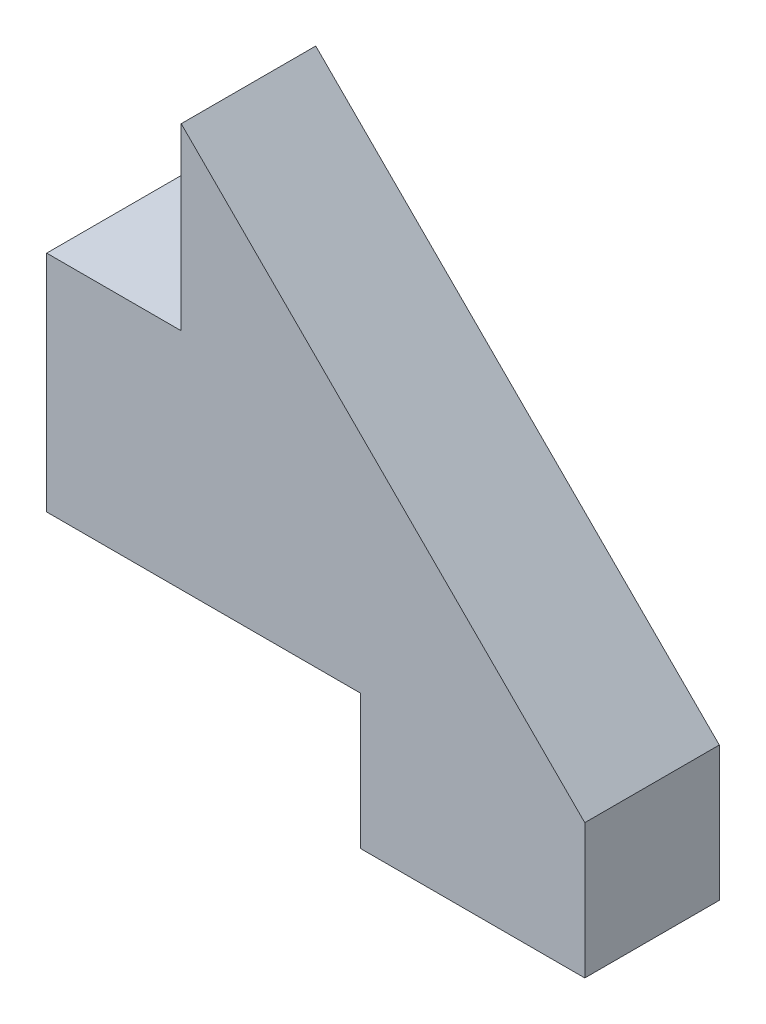
ISO-10303-21;
HEADER;
FILE_DESCRIPTION(('STEP AP214'),'2;1');
FILE_NAME('part.step','',(''),(''),'','','');
FILE_SCHEMA(('AUTOMOTIVE_DESIGN { 1 0 10303 214 1 1 1 1 }'));
ENDSEC;
DATA;
#1=APPLICATION_CONTEXT('core data for automotive mechanical design processes');
#2=APPLICATION_PROTOCOL_DEFINITION('international standard','automotive_design',2000,#1);
#3=PRODUCT_CONTEXT('',#1,'mechanical');
#4=PRODUCT('Part','Part','',(#3));
#5=PRODUCT_RELATED_PRODUCT_CATEGORY('part','',(#4));
#6=PRODUCT_DEFINITION_FORMATION('','',#4);
#7=PRODUCT_DEFINITION_CONTEXT('part definition',#1,'design');
#8=PRODUCT_DEFINITION('design','',#6,#7);
#9=PRODUCT_DEFINITION_SHAPE('','',#8);
#10=(LENGTH_UNIT() NAMED_UNIT(*) SI_UNIT(.MILLI.,.METRE.));
#11=(NAMED_UNIT(*) PLANE_ANGLE_UNIT() SI_UNIT($,.RADIAN.));
#12=(NAMED_UNIT(*) SI_UNIT($,.STERADIAN.) SOLID_ANGLE_UNIT());
#13=UNCERTAINTY_MEASURE_WITH_UNIT(LENGTH_MEASURE(1.E-05),#10,'distance_accuracy_value','');
#14=(GEOMETRIC_REPRESENTATION_CONTEXT(3) GLOBAL_UNCERTAINTY_ASSIGNED_CONTEXT((#13)) GLOBAL_UNIT_ASSIGNED_CONTEXT((#10,
#11,#12)) REPRESENTATION_CONTEXT('',''));
#15=CARTESIAN_POINT('',(0.,0.,0.));
#16=DIRECTION('',(0.,0.,1.));
#17=DIRECTION('',(1.,0.,0.));
#18=AXIS2_PLACEMENT_3D('',#15,#16,#17);
#19=CARTESIAN_POINT('',(0.,10.,6.));
#20=DIRECTION('',(0.,-1.,0.));
#21=DIRECTION('',(1.,0.,0.));
#22=AXIS2_PLACEMENT_3D('',#19,#20,#21);
#23=PLANE('',#22);
#24=DIRECTION('',(-1.,0.,0.));
#25=VECTOR('',#24,1.);
#26=CARTESIAN_POINT('',(0.,10.,0.));
#27=LINE('',#26,#25);
#28=CARTESIAN_POINT('',(6.,10.,0.));
#29=VERTEX_POINT('',#28);
#30=CARTESIAN_POINT('',(0.,10.,0.));
#31=VERTEX_POINT('',#30);
#32=EDGE_CURVE('E129',#29,#31,#27,.T.);
#33=ORIENTED_EDGE('',*,*,#32,.T.);
#34=DIRECTION('',(0.,0.,-1.));
#35=VECTOR('',#34,1.);
#36=CARTESIAN_POINT('',(0.,10.,6.));
#37=LINE('',#36,#35);
#38=CARTESIAN_POINT('',(0.,10.,6.));
#39=VERTEX_POINT('',#38);
#40=EDGE_CURVE('E11',#39,#31,#37,.T.);
#41=ORIENTED_EDGE('',*,*,#40,.F.);
#42=DIRECTION('',(-1.,0.,0.));
#43=VECTOR('',#42,1.);
#44=CARTESIAN_POINT('',(0.,10.,6.));
#45=LINE('',#44,#43);
#46=CARTESIAN_POINT('',(6.,10.,6.));
#47=VERTEX_POINT('',#46);
#48=EDGE_CURVE('E143',#47,#39,#45,.T.);
#49=ORIENTED_EDGE('',*,*,#48,.F.);
#50=DIRECTION('',(0.,0.,-1.));
#51=VECTOR('',#50,1.);
#52=CARTESIAN_POINT('',(6.,10.,6.));
#53=LINE('',#52,#51);
#54=EDGE_CURVE('E125',#47,#29,#53,.T.);
#55=ORIENTED_EDGE('',*,*,#54,.T.);
#56=EDGE_LOOP('',(#33,#41,#49,#55));
#57=FACE_BOUND('',#56,.T.);
#58=ADVANCED_FACE('F33',(#57),#23,.F.);
#59=CARTESIAN_POINT('',(0.,0.,6.));
#60=DIRECTION('',(1.,0.,0.));
#61=DIRECTION('',(0.,0.,-1.));
#62=AXIS2_PLACEMENT_3D('',#59,#60,#61);
#63=PLANE('',#62);
#64=DIRECTION('',(0.,-1.,0.));
#65=VECTOR('',#64,1.);
#66=CARTESIAN_POINT('',(0.,0.,0.));
#67=LINE('',#66,#65);
#68=CARTESIAN_POINT('',(0.,0.,0.));
#69=VERTEX_POINT('',#68);
#70=EDGE_CURVE('E132',#31,#69,#67,.T.);
#71=ORIENTED_EDGE('',*,*,#70,.T.);
#72=DIRECTION('',(0.,0.,-1.));
#73=VECTOR('',#72,1.);
#74=CARTESIAN_POINT('',(0.,0.,6.));
#75=LINE('',#74,#73);
#76=CARTESIAN_POINT('',(0.,0.,6.));
#77=VERTEX_POINT('',#76);
#78=EDGE_CURVE('E41',#77,#69,#75,.T.);
#79=ORIENTED_EDGE('',*,*,#78,.F.);
#80=DIRECTION('',(0.,-1.,0.));
#81=VECTOR('',#80,1.);
#82=CARTESIAN_POINT('',(0.,0.,6.));
#83=LINE('',#82,#81);
#84=EDGE_CURVE('E92',#39,#77,#83,.T.);
#85=ORIENTED_EDGE('',*,*,#84,.F.);
#86=ORIENTED_EDGE('',*,*,#40,.T.);
#87=EDGE_LOOP('',(#71,#79,#85,#86));
#88=FACE_BOUND('',#87,.T.);
#89=ADVANCED_FACE('F178',(#88),#63,.F.);
#90=CARTESIAN_POINT('',(0.,0.,6.));
#91=DIRECTION('',(0.,1.,0.));
#92=DIRECTION('',(0.,0.,1.));
#93=AXIS2_PLACEMENT_3D('',#90,#91,#92);
#94=PLANE('',#93);
#95=DIRECTION('',(1.,0.,0.));
#96=VECTOR('',#95,1.);
#97=CARTESIAN_POINT('',(0.,0.,0.));
#98=LINE('',#97,#96);
#99=CARTESIAN_POINT('',(14.,0.,0.));
#100=VERTEX_POINT('',#99);
#101=EDGE_CURVE('E134',#69,#100,#98,.T.);
#102=ORIENTED_EDGE('',*,*,#101,.T.);
#103=DIRECTION('',(0.,0.,-1.));
#104=VECTOR('',#103,1.);
#105=CARTESIAN_POINT('',(14.,0.,6.));
#106=LINE('',#105,#104);
#107=CARTESIAN_POINT('',(14.,0.,6.));
#108=VERTEX_POINT('',#107);
#109=EDGE_CURVE('E150',#108,#100,#106,.T.);
#110=ORIENTED_EDGE('',*,*,#109,.F.);
#111=DIRECTION('',(1.,0.,0.));
#112=VECTOR('',#111,1.);
#113=CARTESIAN_POINT('',(0.,0.,6.));
#114=LINE('',#113,#112);
#115=EDGE_CURVE('E158',#77,#108,#114,.T.);
#116=ORIENTED_EDGE('',*,*,#115,.F.);
#117=ORIENTED_EDGE('',*,*,#78,.T.);
#118=EDGE_LOOP('',(#102,#110,#116,#117));
#119=FACE_BOUND('',#118,.T.);
#120=ADVANCED_FACE('F156',(#119),#94,.F.);
#121=CARTESIAN_POINT('',(14.,-6.,6.));
#122=DIRECTION('',(1.,0.,0.));
#123=DIRECTION('',(0.,0.,-1.));
#124=AXIS2_PLACEMENT_3D('',#121,#122,#123);
#125=PLANE('',#124);
#126=DIRECTION('',(0.,-1.,0.));
#127=VECTOR('',#126,1.);
#128=CARTESIAN_POINT('',(14.,-6.,0.));
#129=LINE('',#128,#127);
#130=CARTESIAN_POINT('',(14.,-6.,0.));
#131=VERTEX_POINT('',#130);
#132=EDGE_CURVE('E136',#100,#131,#129,.T.);
#133=ORIENTED_EDGE('',*,*,#132,.T.);
#134=DIRECTION('',(0.,0.,-1.));
#135=VECTOR('',#134,1.);
#136=CARTESIAN_POINT('',(14.,-6.,6.));
#137=LINE('',#136,#135);
#138=CARTESIAN_POINT('',(14.,-6.,6.));
#139=VERTEX_POINT('',#138);
#140=EDGE_CURVE('E147',#139,#131,#137,.T.);
#141=ORIENTED_EDGE('',*,*,#140,.F.);
#142=DIRECTION('',(0.,-1.,0.));
#143=VECTOR('',#142,1.);
#144=CARTESIAN_POINT('',(14.,-6.,6.));
#145=LINE('',#144,#143);
#146=EDGE_CURVE('E170',#108,#139,#145,.T.);
#147=ORIENTED_EDGE('',*,*,#146,.F.);
#148=ORIENTED_EDGE('',*,*,#109,.T.);
#149=EDGE_LOOP('',(#133,#141,#147,#148));
#150=FACE_BOUND('',#149,.T.);
#151=ADVANCED_FACE('F166',(#150),#125,.F.);
#152=CARTESIAN_POINT('',(24.,-6.,6.));
#153=DIRECTION('',(0.,1.,0.));
#154=DIRECTION('',(-1.,0.,0.));
#155=AXIS2_PLACEMENT_3D('',#152,#153,#154);
#156=PLANE('',#155);
#157=DIRECTION('',(1.,0.,0.));
#158=VECTOR('',#157,1.);
#159=CARTESIAN_POINT('',(24.,-6.,0.));
#160=LINE('',#159,#158);
#161=CARTESIAN_POINT('',(24.,-6.,0.));
#162=VERTEX_POINT('',#161);
#163=EDGE_CURVE('E138',#131,#162,#160,.T.);
#164=ORIENTED_EDGE('',*,*,#163,.T.);
#165=DIRECTION('',(0.,0.,-1.));
#166=VECTOR('',#165,1.);
#167=CARTESIAN_POINT('',(24.,-6.,6.));
#168=LINE('',#167,#166);
#169=CARTESIAN_POINT('',(24.,-6.,6.));
#170=VERTEX_POINT('',#169);
#171=EDGE_CURVE('E120',#170,#162,#168,.T.);
#172=ORIENTED_EDGE('',*,*,#171,.F.);
#173=DIRECTION('',(1.,0.,0.));
#174=VECTOR('',#173,1.);
#175=CARTESIAN_POINT('',(24.,-6.,6.));
#176=LINE('',#175,#174);
#177=EDGE_CURVE('E111',#139,#170,#176,.T.);
#178=ORIENTED_EDGE('',*,*,#177,.F.);
#179=ORIENTED_EDGE('',*,*,#140,.T.);
#180=EDGE_LOOP('',(#164,#172,#178,#179));
#181=FACE_BOUND('',#180,.T.);
#182=ADVANCED_FACE('F169',(#181),#156,.F.);
#183=CARTESIAN_POINT('',(24.,0.,6.));
#184=DIRECTION('',(-1.,0.,0.));
#185=DIRECTION('',(0.,0.,1.));
#186=AXIS2_PLACEMENT_3D('',#183,#184,#185);
#187=PLANE('',#186);
#188=DIRECTION('',(0.,1.,0.));
#189=VECTOR('',#188,1.);
#190=CARTESIAN_POINT('',(24.,0.,0.));
#191=LINE('',#190,#189);
#192=CARTESIAN_POINT('',(24.,0.,0.));
#193=VERTEX_POINT('',#192);
#194=EDGE_CURVE('E119',#162,#193,#191,.T.);
#195=ORIENTED_EDGE('',*,*,#194,.T.);
#196=DIRECTION('',(0.,0.,-1.));
#197=VECTOR('',#196,1.);
#198=CARTESIAN_POINT('',(24.,0.,6.));
#199=LINE('',#198,#197);
#200=CARTESIAN_POINT('',(24.,0.,6.));
#201=VERTEX_POINT('',#200);
#202=EDGE_CURVE('E116',#201,#193,#199,.T.);
#203=ORIENTED_EDGE('',*,*,#202,.F.);
#204=DIRECTION('',(0.,1.,0.));
#205=VECTOR('',#204,1.);
#206=CARTESIAN_POINT('',(24.,0.,6.));
#207=LINE('',#206,#205);
#208=EDGE_CURVE('E105',#170,#201,#207,.T.);
#209=ORIENTED_EDGE('',*,*,#208,.F.);
#210=ORIENTED_EDGE('',*,*,#171,.T.);
#211=EDGE_LOOP('',(#195,#203,#209,#210));
#212=FACE_BOUND('',#211,.T.);
#213=ADVANCED_FACE('F117',(#212),#187,.F.);
#214=CARTESIAN_POINT('',(6.,18.,6.));
#215=DIRECTION('',(-0.707106781186548,-0.707106781186548,0.));
#216=DIRECTION('',(0.707106781186548,-0.707106781186548,0.));
#217=AXIS2_PLACEMENT_3D('',#214,#215,#216);
#218=PLANE('',#217);
#219=DIRECTION('',(-0.707106781186547,0.707106781186547,0.));
#220=VECTOR('',#219,1.);
#221=CARTESIAN_POINT('',(6.,18.,0.));
#222=LINE('',#221,#220);
#223=CARTESIAN_POINT('',(6.,18.,0.));
#224=VERTEX_POINT('',#223);
#225=EDGE_CURVE('E78',#193,#224,#222,.T.);
#226=ORIENTED_EDGE('',*,*,#225,.T.);
#227=DIRECTION('',(0.,0.,-1.));
#228=VECTOR('',#227,1.);
#229=CARTESIAN_POINT('',(6.,18.,6.));
#230=LINE('',#229,#228);
#231=CARTESIAN_POINT('',(6.,18.,6.));
#232=VERTEX_POINT('',#231);
#233=EDGE_CURVE('E121',#232,#224,#230,.T.);
#234=ORIENTED_EDGE('',*,*,#233,.F.);
#235=DIRECTION('',(-0.707106781186547,0.707106781186547,0.));
#236=VECTOR('',#235,1.);
#237=CARTESIAN_POINT('',(6.,18.,6.));
#238=LINE('',#237,#236);
#239=EDGE_CURVE('E109',#201,#232,#238,.T.);
#240=ORIENTED_EDGE('',*,*,#239,.F.);
#241=ORIENTED_EDGE('',*,*,#202,.T.);
#242=EDGE_LOOP('',(#226,#234,#240,#241));
#243=FACE_BOUND('',#242,.T.);
#244=ADVANCED_FACE('F123',(#243),#218,.F.);
#245=CARTESIAN_POINT('',(6.,10.,6.));
#246=DIRECTION('',(1.,0.,0.));
#247=DIRECTION('',(0.,1.,0.));
#248=AXIS2_PLACEMENT_3D('',#245,#246,#247);
#249=PLANE('',#248);
#250=DIRECTION('',(0.,-1.,0.));
#251=VECTOR('',#250,1.);
#252=CARTESIAN_POINT('',(6.,10.,0.));
#253=LINE('',#252,#251);
#254=EDGE_CURVE('E84',#224,#29,#253,.T.);
#255=ORIENTED_EDGE('',*,*,#254,.T.);
#256=ORIENTED_EDGE('',*,*,#54,.F.);
#257=DIRECTION('',(0.,-1.,0.));
#258=VECTOR('',#257,1.);
#259=CARTESIAN_POINT('',(6.,10.,6.));
#260=LINE('',#259,#258);
#261=EDGE_CURVE('E49',#232,#47,#260,.T.);
#262=ORIENTED_EDGE('',*,*,#261,.F.);
#263=ORIENTED_EDGE('',*,*,#233,.T.);
#264=EDGE_LOOP('',(#255,#256,#262,#263));
#265=FACE_BOUND('',#264,.T.);
#266=ADVANCED_FACE('F194',(#265),#249,.F.);
#267=CARTESIAN_POINT('',(0.,0.,6.));
#268=DIRECTION('',(0.,0.,1.));
#269=DIRECTION('',(1.,0.,0.));
#270=AXIS2_PLACEMENT_3D('',#267,#268,#269);
#271=PLANE('',#270);
#272=ORIENTED_EDGE('',*,*,#48,.T.);
#273=ORIENTED_EDGE('',*,*,#84,.T.);
#274=ORIENTED_EDGE('',*,*,#115,.T.);
#275=ORIENTED_EDGE('',*,*,#146,.T.);
#276=ORIENTED_EDGE('',*,*,#177,.T.);
#277=ORIENTED_EDGE('',*,*,#208,.T.);
#278=ORIENTED_EDGE('',*,*,#239,.T.);
#279=ORIENTED_EDGE('',*,*,#261,.T.);
#280=EDGE_LOOP('',(#272,#273,#274,#275,#276,#277,#278,#279));
#281=FACE_BOUND('',#280,.T.);
#282=ADVANCED_FACE('F107',(#281),#271,.T.);
#283=CARTESIAN_POINT('',(0.,0.,0.));
#284=DIRECTION('',(0.,0.,1.));
#285=DIRECTION('',(1.,0.,0.));
#286=AXIS2_PLACEMENT_3D('',#283,#284,#285);
#287=PLANE('',#286);
#288=ORIENTED_EDGE('',*,*,#32,.F.);
#289=ORIENTED_EDGE('',*,*,#254,.F.);
#290=ORIENTED_EDGE('',*,*,#225,.F.);
#291=ORIENTED_EDGE('',*,*,#194,.F.);
#292=ORIENTED_EDGE('',*,*,#163,.F.);
#293=ORIENTED_EDGE('',*,*,#132,.F.);
#294=ORIENTED_EDGE('',*,*,#101,.F.);
#295=ORIENTED_EDGE('',*,*,#70,.F.);
#296=EDGE_LOOP('',(#288,#289,#290,#291,#292,#293,#294,#295));
#297=FACE_BOUND('',#296,.T.);
#298=ADVANCED_FACE('F162',(#297),#287,.F.);
#299=CLOSED_SHELL('',(#58,#89,#120,#151,#182,#213,#244,#266,#282,#298));
#300=MANIFOLD_SOLID_BREP('B2',#299);
#301=ADVANCED_BREP_SHAPE_REPRESENTATION('',(#18,#300),#14);
#302=SHAPE_DEFINITION_REPRESENTATION(#9,#301);
ENDSEC;
END-ISO-10303-21;
